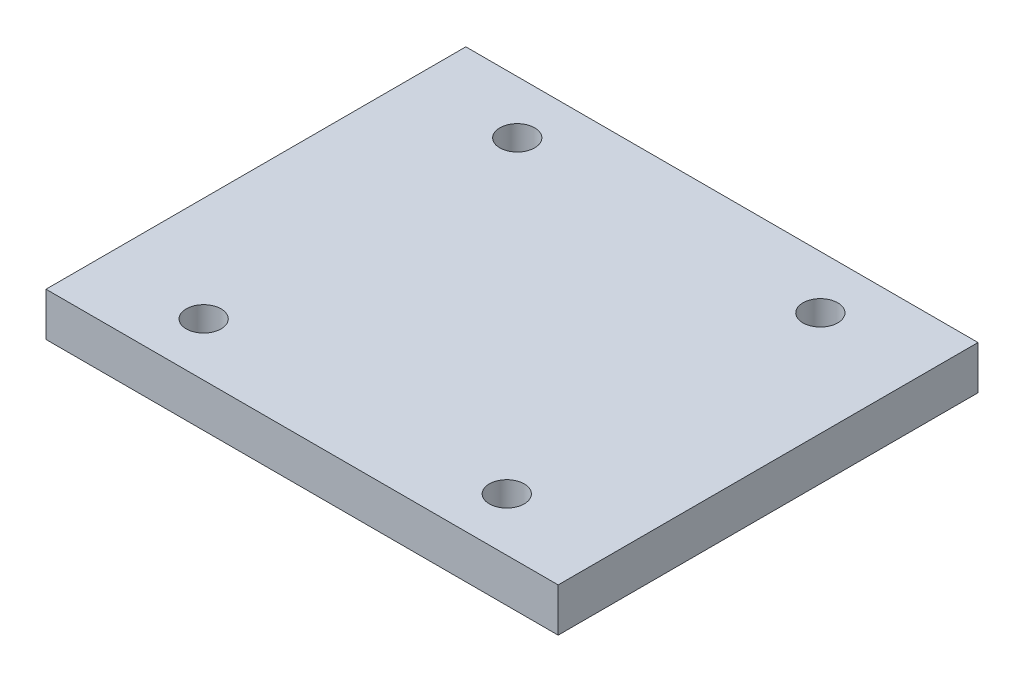
ISO-10303-21;
HEADER;
FILE_DESCRIPTION(('STEP AP214'),'2;1');
FILE_NAME('part.step','',(''),(''),'','','');
FILE_SCHEMA(('AUTOMOTIVE_DESIGN { 1 0 10303 214 1 1 1 1 }'));
ENDSEC;
DATA;
#1=APPLICATION_CONTEXT('core data for automotive mechanical design processes');
#2=APPLICATION_PROTOCOL_DEFINITION('international standard','automotive_design',2000,#1);
#3=PRODUCT_CONTEXT('',#1,'mechanical');
#4=PRODUCT('Part','Part','',(#3));
#5=PRODUCT_RELATED_PRODUCT_CATEGORY('part','',(#4));
#6=PRODUCT_DEFINITION_FORMATION('','',#4);
#7=PRODUCT_DEFINITION_CONTEXT('part definition',#1,'design');
#8=PRODUCT_DEFINITION('design','',#6,#7);
#9=PRODUCT_DEFINITION_SHAPE('','',#8);
#10=(LENGTH_UNIT() NAMED_UNIT(*) SI_UNIT(.MILLI.,.METRE.));
#11=(NAMED_UNIT(*) PLANE_ANGLE_UNIT() SI_UNIT($,.RADIAN.));
#12=(NAMED_UNIT(*) SI_UNIT($,.STERADIAN.) SOLID_ANGLE_UNIT());
#13=UNCERTAINTY_MEASURE_WITH_UNIT(LENGTH_MEASURE(1.E-05),#10,'distance_accuracy_value','');
#14=(GEOMETRIC_REPRESENTATION_CONTEXT(3) GLOBAL_UNCERTAINTY_ASSIGNED_CONTEXT((#13)) GLOBAL_UNIT_ASSIGNED_CONTEXT((#10,
#11,#12)) REPRESENTATION_CONTEXT('',''));
#15=CARTESIAN_POINT('',(0.,0.,0.));
#16=DIRECTION('',(0.,0.,1.));
#17=DIRECTION('',(1.,0.,0.));
#18=AXIS2_PLACEMENT_3D('',#15,#16,#17);
#19=CARTESIAN_POINT('',(0.,2.5,0.));
#20=DIRECTION('',(0.,-1.,0.));
#21=DIRECTION('',(0.,0.,-1.));
#22=AXIS2_PLACEMENT_3D('',#19,#20,#21);
#23=PLANE('',#22);
#24=DIRECTION('',(0.,0.,-1.));
#25=VECTOR('',#24,1.);
#26=CARTESIAN_POINT('',(13.9,2.5,12.));
#27=LINE('',#26,#25);
#28=CARTESIAN_POINT('',(13.9,2.5,12.5));
#29=VERTEX_POINT('',#28);
#30=CARTESIAN_POINT('',(13.9,2.5,-11.6));
#31=VERTEX_POINT('',#30);
#32=EDGE_CURVE('E42',#29,#31,#27,.T.);
#33=ORIENTED_EDGE('',*,*,#32,.T.);
#34=DIRECTION('',(1.,0.,0.));
#35=VECTOR('',#34,1.);
#36=CARTESIAN_POINT('',(-15.5,2.5,-11.6));
#37=LINE('',#36,#35);
#38=CARTESIAN_POINT('',(-15.5,2.5,-11.6));
#39=VERTEX_POINT('',#38);
#40=EDGE_CURVE('E103',#39,#31,#37,.T.);
#41=ORIENTED_EDGE('',*,*,#40,.F.);
#42=DIRECTION('',(0.,0.,1.));
#43=VECTOR('',#42,1.);
#44=CARTESIAN_POINT('',(-15.5,2.5,12.));
#45=LINE('',#44,#43);
#46=CARTESIAN_POINT('',(-15.5,2.5,12.5));
#47=VERTEX_POINT('',#46);
#48=EDGE_CURVE('E11',#39,#47,#45,.T.);
#49=ORIENTED_EDGE('',*,*,#48,.T.);
#50=DIRECTION('',(-1.,0.,0.));
#51=VECTOR('',#50,1.);
#52=CARTESIAN_POINT('',(13.9,2.5,12.5));
#53=LINE('',#52,#51);
#54=EDGE_CURVE('E92',#29,#47,#53,.T.);
#55=ORIENTED_EDGE('',*,*,#54,.F.);
#56=EDGE_LOOP('',(#33,#41,#49,#55));
#57=FACE_BOUND('',#56,.T.);
#58=CARTESIAN_POINT('',(-9.5,2.5,-8.55));
#59=DIRECTION('',(0.,1.,0.));
#60=DIRECTION('',(0.,0.,1.));
#61=AXIS2_PLACEMENT_3D('',#58,#59,#60);
#62=CIRCLE('',#61,1.);
#63=CARTESIAN_POINT('',(-9.5,2.5,-7.55));
#64=VERTEX_POINT('',#63);
#65=EDGE_CURVE('E124',#64,#64,#62,.T.);
#66=ORIENTED_EDGE('',*,*,#65,.F.);
#67=EDGE_LOOP('',(#66));
#68=FACE_BOUND('',#67,.T.);
#69=CARTESIAN_POINT('',(7.9,2.5,-8.55));
#70=DIRECTION('',(0.,1.,0.));
#71=DIRECTION('',(0.,0.,1.));
#72=AXIS2_PLACEMENT_3D('',#69,#70,#71);
#73=CIRCLE('',#72,1.);
#74=CARTESIAN_POINT('',(7.9,2.5,-7.55));
#75=VERTEX_POINT('',#74);
#76=EDGE_CURVE('E118',#75,#75,#73,.T.);
#77=ORIENTED_EDGE('',*,*,#76,.F.);
#78=EDGE_LOOP('',(#77));
#79=FACE_BOUND('',#78,.T.);
#80=CARTESIAN_POINT('',(7.9,2.5,9.45));
#81=DIRECTION('',(0.,1.,0.));
#82=DIRECTION('',(0.,0.,1.));
#83=AXIS2_PLACEMENT_3D('',#80,#81,#82);
#84=CIRCLE('',#83,1.);
#85=CARTESIAN_POINT('',(7.9,2.5,10.45));
#86=VERTEX_POINT('',#85);
#87=EDGE_CURVE('E112',#86,#86,#84,.T.);
#88=ORIENTED_EDGE('',*,*,#87,.F.);
#89=EDGE_LOOP('',(#88));
#90=FACE_BOUND('',#89,.T.);
#91=CARTESIAN_POINT('',(-9.5,2.5,9.45));
#92=DIRECTION('',(0.,1.,0.));
#93=DIRECTION('',(0.,0.,1.));
#94=AXIS2_PLACEMENT_3D('',#91,#92,#93);
#95=CIRCLE('',#94,0.999999999999999);
#96=CARTESIAN_POINT('',(-9.5,2.5,10.45));
#97=VERTEX_POINT('',#96);
#98=EDGE_CURVE('E106',#97,#97,#95,.T.);
#99=ORIENTED_EDGE('',*,*,#98,.F.);
#100=EDGE_LOOP('',(#99));
#101=FACE_BOUND('',#100,.T.);
#102=ADVANCED_FACE('F33',(#57,#68,#79,#90,#101),#23,.F.);
#103=CARTESIAN_POINT('',(0.,0.,0.));
#104=DIRECTION('',(0.,-1.,0.));
#105=DIRECTION('',(0.,0.,-1.));
#106=AXIS2_PLACEMENT_3D('',#103,#104,#105);
#107=PLANE('',#106);
#108=CARTESIAN_POINT('',(7.9,0.,9.45));
#109=DIRECTION('',(0.,1.,0.));
#110=DIRECTION('',(0.,0.,1.));
#111=AXIS2_PLACEMENT_3D('',#108,#109,#110);
#112=CIRCLE('',#111,1.);
#113=CARTESIAN_POINT('',(7.9,0.,10.45));
#114=VERTEX_POINT('',#113);
#115=EDGE_CURVE('E109',#114,#114,#112,.T.);
#116=ORIENTED_EDGE('',*,*,#115,.T.);
#117=EDGE_LOOP('',(#116));
#118=FACE_BOUND('',#117,.T.);
#119=CARTESIAN_POINT('',(-9.5,0.,-8.55));
#120=DIRECTION('',(0.,1.,0.));
#121=DIRECTION('',(0.,0.,1.));
#122=AXIS2_PLACEMENT_3D('',#119,#120,#121);
#123=CIRCLE('',#122,1.);
#124=CARTESIAN_POINT('',(-9.5,0.,-7.55));
#125=VERTEX_POINT('',#124);
#126=EDGE_CURVE('E121',#125,#125,#123,.T.);
#127=ORIENTED_EDGE('',*,*,#126,.T.);
#128=EDGE_LOOP('',(#127));
#129=FACE_BOUND('',#128,.T.);
#130=DIRECTION('',(0.,0.,-1.));
#131=VECTOR('',#130,1.);
#132=CARTESIAN_POINT('',(13.9,0.,12.));
#133=LINE('',#132,#131);
#134=CARTESIAN_POINT('',(13.9,0.,12.5));
#135=VERTEX_POINT('',#134);
#136=CARTESIAN_POINT('',(13.9,0.,-11.6));
#137=VERTEX_POINT('',#136);
#138=EDGE_CURVE('E80',#135,#137,#133,.T.);
#139=ORIENTED_EDGE('',*,*,#138,.F.);
#140=DIRECTION('',(1.,0.,0.));
#141=VECTOR('',#140,1.);
#142=CARTESIAN_POINT('',(-15.5,0.,12.5));
#143=LINE('',#142,#141);
#144=CARTESIAN_POINT('',(-15.5,0.,12.5));
#145=VERTEX_POINT('',#144);
#146=EDGE_CURVE('E82',#145,#135,#143,.T.);
#147=ORIENTED_EDGE('',*,*,#146,.F.);
#148=DIRECTION('',(0.,0.,1.));
#149=VECTOR('',#148,1.);
#150=CARTESIAN_POINT('',(-15.5,0.,12.));
#151=LINE('',#150,#149);
#152=CARTESIAN_POINT('',(-15.5,0.,-11.6));
#153=VERTEX_POINT('',#152);
#154=EDGE_CURVE('E37',#153,#145,#151,.T.);
#155=ORIENTED_EDGE('',*,*,#154,.F.);
#156=DIRECTION('',(-1.,0.,0.));
#157=VECTOR('',#156,1.);
#158=CARTESIAN_POINT('',(13.9,0.,-11.6));
#159=LINE('',#158,#157);
#160=EDGE_CURVE('E100',#137,#153,#159,.T.);
#161=ORIENTED_EDGE('',*,*,#160,.F.);
#162=EDGE_LOOP('',(#139,#147,#155,#161));
#163=FACE_BOUND('',#162,.T.);
#164=CARTESIAN_POINT('',(7.9,0.,-8.55));
#165=DIRECTION('',(0.,1.,0.));
#166=DIRECTION('',(0.,0.,1.));
#167=AXIS2_PLACEMENT_3D('',#164,#165,#166);
#168=CIRCLE('',#167,1.);
#169=CARTESIAN_POINT('',(7.9,0.,-7.55));
#170=VERTEX_POINT('',#169);
#171=EDGE_CURVE('E115',#170,#170,#168,.T.);
#172=ORIENTED_EDGE('',*,*,#171,.T.);
#173=EDGE_LOOP('',(#172));
#174=FACE_BOUND('',#173,.T.);
#175=CARTESIAN_POINT('',(-9.5,0.,9.45));
#176=DIRECTION('',(0.,1.,0.));
#177=DIRECTION('',(0.,0.,1.));
#178=AXIS2_PLACEMENT_3D('',#175,#176,#177);
#179=CIRCLE('',#178,0.999999999999999);
#180=CARTESIAN_POINT('',(-9.5,0.,10.45));
#181=VERTEX_POINT('',#180);
#182=EDGE_CURVE('E105',#181,#181,#179,.T.);
#183=ORIENTED_EDGE('',*,*,#182,.T.);
#184=EDGE_LOOP('',(#183));
#185=FACE_BOUND('',#184,.T.);
#186=ADVANCED_FACE('F83',(#118,#129,#163,#174,#185),#107,.T.);
#187=CARTESIAN_POINT('',(13.9,2.5,12.));
#188=DIRECTION('',(-1.,0.,0.));
#189=DIRECTION('',(0.,0.,1.));
#190=AXIS2_PLACEMENT_3D('',#187,#188,#189);
#191=PLANE('',#190);
#192=ORIENTED_EDGE('',*,*,#138,.T.);
#193=DIRECTION('',(0.,-1.,0.));
#194=VECTOR('',#193,1.);
#195=CARTESIAN_POINT('',(13.9,2.5,-11.6));
#196=LINE('',#195,#194);
#197=EDGE_CURVE('E97',#31,#137,#196,.T.);
#198=ORIENTED_EDGE('',*,*,#197,.F.);
#199=ORIENTED_EDGE('',*,*,#32,.F.);
#200=DIRECTION('',(0.,1.,0.));
#201=VECTOR('',#200,1.);
#202=CARTESIAN_POINT('',(13.9,0.,12.5));
#203=LINE('',#202,#201);
#204=EDGE_CURVE('E88',#135,#29,#203,.T.);
#205=ORIENTED_EDGE('',*,*,#204,.F.);
#206=EDGE_LOOP('',(#192,#198,#199,#205));
#207=FACE_BOUND('',#206,.T.);
#208=ADVANCED_FACE('F35',(#207),#191,.F.);
#209=CARTESIAN_POINT('',(-15.5,2.5,12.));
#210=DIRECTION('',(1.,0.,0.));
#211=DIRECTION('',(0.,0.,-1.));
#212=AXIS2_PLACEMENT_3D('',#209,#210,#211);
#213=PLANE('',#212);
#214=ORIENTED_EDGE('',*,*,#154,.T.);
#215=DIRECTION('',(0.,-1.,0.));
#216=VECTOR('',#215,1.);
#217=CARTESIAN_POINT('',(-15.5,2.5,12.5));
#218=LINE('',#217,#216);
#219=EDGE_CURVE('E75',#47,#145,#218,.T.);
#220=ORIENTED_EDGE('',*,*,#219,.F.);
#221=ORIENTED_EDGE('',*,*,#48,.F.);
#222=DIRECTION('',(0.,1.,0.));
#223=VECTOR('',#222,1.);
#224=CARTESIAN_POINT('',(-15.5,0.,-11.6));
#225=LINE('',#224,#223);
#226=EDGE_CURVE('E76',#153,#39,#225,.T.);
#227=ORIENTED_EDGE('',*,*,#226,.F.);
#228=EDGE_LOOP('',(#214,#220,#221,#227));
#229=FACE_BOUND('',#228,.T.);
#230=ADVANCED_FACE('F73',(#229),#213,.F.);
#231=CARTESIAN_POINT('',(-9.5,2.5,-8.55));
#232=DIRECTION('',(0.,-1.,0.));
#233=DIRECTION('',(0.,0.,-1.));
#234=AXIS2_PLACEMENT_3D('',#231,#232,#233);
#235=CYLINDRICAL_SURFACE('',#234,1.);
#236=ORIENTED_EDGE('',*,*,#65,.T.);
#237=EDGE_LOOP('',(#236));
#238=FACE_BOUND('',#237,.T.);
#239=ORIENTED_EDGE('',*,*,#126,.F.);
#240=EDGE_LOOP('',(#239));
#241=FACE_BOUND('',#240,.T.);
#242=ADVANCED_FACE('F160',(#238,#241),#235,.F.);
#243=CARTESIAN_POINT('',(7.9,2.5,-8.55));
#244=DIRECTION('',(0.,-1.,0.));
#245=DIRECTION('',(0.,0.,-1.));
#246=AXIS2_PLACEMENT_3D('',#243,#244,#245);
#247=CYLINDRICAL_SURFACE('',#246,1.);
#248=ORIENTED_EDGE('',*,*,#76,.T.);
#249=EDGE_LOOP('',(#248));
#250=FACE_BOUND('',#249,.T.);
#251=ORIENTED_EDGE('',*,*,#171,.F.);
#252=EDGE_LOOP('',(#251));
#253=FACE_BOUND('',#252,.T.);
#254=ADVANCED_FACE('F164',(#250,#253),#247,.F.);
#255=CARTESIAN_POINT('',(7.9,2.5,9.45));
#256=DIRECTION('',(0.,-1.,0.));
#257=DIRECTION('',(0.,0.,-1.));
#258=AXIS2_PLACEMENT_3D('',#255,#256,#257);
#259=CYLINDRICAL_SURFACE('',#258,1.);
#260=ORIENTED_EDGE('',*,*,#87,.T.);
#261=EDGE_LOOP('',(#260));
#262=FACE_BOUND('',#261,.T.);
#263=ORIENTED_EDGE('',*,*,#115,.F.);
#264=EDGE_LOOP('',(#263));
#265=FACE_BOUND('',#264,.T.);
#266=ADVANCED_FACE('F147',(#262,#265),#259,.F.);
#267=CARTESIAN_POINT('',(-9.5,2.5,9.45));
#268=DIRECTION('',(0.,-1.,0.));
#269=DIRECTION('',(0.,0.,-1.));
#270=AXIS2_PLACEMENT_3D('',#267,#268,#269);
#271=CYLINDRICAL_SURFACE('',#270,0.999999999999999);
#272=ORIENTED_EDGE('',*,*,#98,.T.);
#273=EDGE_LOOP('',(#272));
#274=FACE_BOUND('',#273,.T.);
#275=ORIENTED_EDGE('',*,*,#182,.F.);
#276=EDGE_LOOP('',(#275));
#277=FACE_BOUND('',#276,.T.);
#278=ADVANCED_FACE('F144',(#274,#277),#271,.F.);
#279=CARTESIAN_POINT('',(0.,0.,-11.6));
#280=DIRECTION('',(0.,0.,-1.));
#281=DIRECTION('',(-1.,0.,0.));
#282=AXIS2_PLACEMENT_3D('',#279,#280,#281);
#283=PLANE('',#282);
#284=ORIENTED_EDGE('',*,*,#197,.T.);
#285=ORIENTED_EDGE('',*,*,#160,.T.);
#286=ORIENTED_EDGE('',*,*,#226,.T.);
#287=ORIENTED_EDGE('',*,*,#40,.T.);
#288=EDGE_LOOP('',(#284,#285,#286,#287));
#289=FACE_BOUND('',#288,.T.);
#290=ADVANCED_FACE('F132',(#289),#283,.T.);
#291=CARTESIAN_POINT('',(0.,0.,12.5));
#292=DIRECTION('',(0.,0.,1.));
#293=DIRECTION('',(1.,0.,0.));
#294=AXIS2_PLACEMENT_3D('',#291,#292,#293);
#295=PLANE('',#294);
#296=ORIENTED_EDGE('',*,*,#219,.T.);
#297=ORIENTED_EDGE('',*,*,#146,.T.);
#298=ORIENTED_EDGE('',*,*,#204,.T.);
#299=ORIENTED_EDGE('',*,*,#54,.T.);
#300=EDGE_LOOP('',(#296,#297,#298,#299));
#301=FACE_BOUND('',#300,.T.);
#302=ADVANCED_FACE('F91',(#301),#295,.T.);
#303=CLOSED_SHELL('',(#102,#186,#208,#230,#242,#254,#266,#278,#290,#302));
#304=MANIFOLD_SOLID_BREP('B2',#303);
#305=ADVANCED_BREP_SHAPE_REPRESENTATION('',(#18,#304),#14);
#306=SHAPE_DEFINITION_REPRESENTATION(#9,#305);
ENDSEC;
END-ISO-10303-21;
